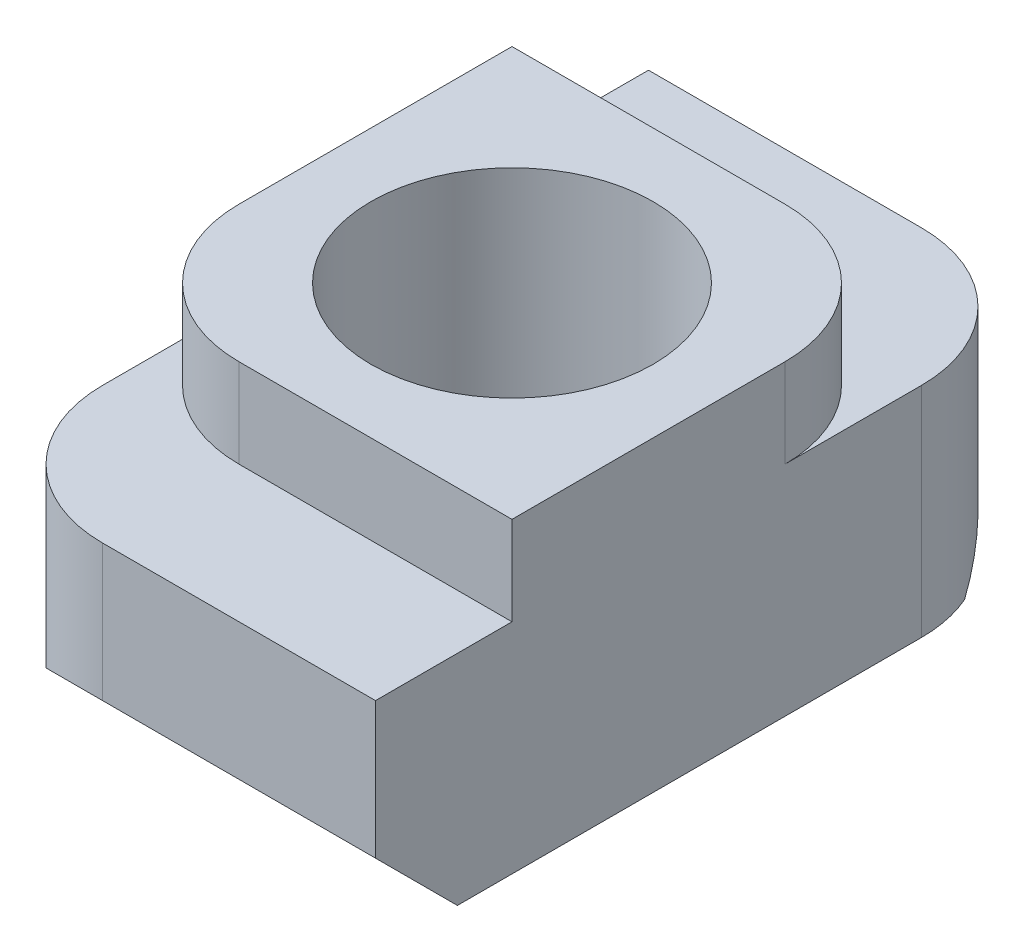
ISO-10303-21;
HEADER;
FILE_DESCRIPTION(('STEP AP214'),'2;1');
FILE_NAME('part.step','',(''),(''),'','','');
FILE_SCHEMA(('AUTOMOTIVE_DESIGN { 1 0 10303 214 1 1 1 1 }'));
ENDSEC;
DATA;
#1=APPLICATION_CONTEXT('core data for automotive mechanical design processes');
#2=APPLICATION_PROTOCOL_DEFINITION('international standard','automotive_design',2000,#1);
#3=PRODUCT_CONTEXT('',#1,'mechanical');
#4=PRODUCT('Part','Part','',(#3));
#5=PRODUCT_RELATED_PRODUCT_CATEGORY('part','',(#4));
#6=PRODUCT_DEFINITION_FORMATION('','',#4);
#7=PRODUCT_DEFINITION_CONTEXT('part definition',#1,'design');
#8=PRODUCT_DEFINITION('design','',#6,#7);
#9=PRODUCT_DEFINITION_SHAPE('','',#8);
#10=(LENGTH_UNIT() NAMED_UNIT(*) SI_UNIT(.MILLI.,.METRE.));
#11=(NAMED_UNIT(*) PLANE_ANGLE_UNIT() SI_UNIT($,.RADIAN.));
#12=(NAMED_UNIT(*) SI_UNIT($,.STERADIAN.) SOLID_ANGLE_UNIT());
#13=UNCERTAINTY_MEASURE_WITH_UNIT(LENGTH_MEASURE(1.E-05),#10,'distance_accuracy_value','');
#14=(GEOMETRIC_REPRESENTATION_CONTEXT(3) GLOBAL_UNCERTAINTY_ASSIGNED_CONTEXT((#13)) GLOBAL_UNIT_ASSIGNED_CONTEXT((#10,
#11,#12)) REPRESENTATION_CONTEXT('',''));
#15=CARTESIAN_POINT('',(0.,0.,0.));
#16=DIRECTION('',(0.,0.,1.));
#17=DIRECTION('',(1.,0.,0.));
#18=AXIS2_PLACEMENT_3D('',#15,#16,#17);
#19=CARTESIAN_POINT('',(3.,-1.3,3.));
#20=DIRECTION('',(0.,0.,-1.));
#21=DIRECTION('',(-1.,0.,0.));
#22=AXIS2_PLACEMENT_3D('',#19,#20,#21);
#23=PLANE('',#22);
#24=DIRECTION('',(-1.,0.,0.));
#25=VECTOR('',#24,1.);
#26=CARTESIAN_POINT('',(3.,0.,3.));
#27=LINE('',#26,#25);
#28=CARTESIAN_POINT('',(3.,0.,3.));
#29=VERTEX_POINT('',#28);
#30=CARTESIAN_POINT('',(-1.,0.,3.));
#31=VERTEX_POINT('',#30);
#32=EDGE_CURVE('E225',#29,#31,#27,.T.);
#33=ORIENTED_EDGE('',*,*,#32,.T.);
#34=DIRECTION('',(0.,-1.,0.));
#35=VECTOR('',#34,1.);
#36=CARTESIAN_POINT('',(-1.,-1.3,3.));
#37=LINE('',#36,#35);
#38=CARTESIAN_POINT('',(-1.,-1.3,3.));
#39=VERTEX_POINT('',#38);
#40=EDGE_CURVE('E163',#31,#39,#37,.T.);
#41=ORIENTED_EDGE('',*,*,#40,.T.);
#42=DIRECTION('',(-1.,0.,0.));
#43=VECTOR('',#42,1.);
#44=CARTESIAN_POINT('',(3.,-1.3,3.));
#45=LINE('',#44,#43);
#46=CARTESIAN_POINT('',(3.,-1.3,3.));
#47=VERTEX_POINT('',#46);
#48=EDGE_CURVE('E142',#47,#39,#45,.T.);
#49=ORIENTED_EDGE('',*,*,#48,.F.);
#50=DIRECTION('',(0.,-1.,0.));
#51=VECTOR('',#50,1.);
#52=CARTESIAN_POINT('',(3.,-1.3,3.));
#53=LINE('',#52,#51);
#54=EDGE_CURVE('E148',#29,#47,#53,.T.);
#55=ORIENTED_EDGE('',*,*,#54,.F.);
#56=EDGE_LOOP('',(#33,#41,#49,#55));
#57=FACE_BOUND('',#56,.T.);
#58=ADVANCED_FACE('F38',(#57),#23,.F.);
#59=CARTESIAN_POINT('',(3.,-1.3,5.));
#60=DIRECTION('',(0.,-1.,0.));
#61=DIRECTION('',(0.,0.,-1.));
#62=AXIS2_PLACEMENT_3D('',#59,#60,#61);
#63=PLANE('',#62);
#64=ORIENTED_EDGE('',*,*,#48,.T.);
#65=CARTESIAN_POINT('',(-1.,-1.3,1.));
#66=DIRECTION('',(0.,-1.,0.));
#67=DIRECTION('',(0.,0.,-1.));
#68=AXIS2_PLACEMENT_3D('',#65,#66,#67);
#69=CIRCLE('',#68,2.);
#70=CARTESIAN_POINT('',(-3.,-1.3,1.));
#71=VERTEX_POINT('',#70);
#72=EDGE_CURVE('E11',#39,#71,#69,.T.);
#73=ORIENTED_EDGE('',*,*,#72,.T.);
#74=DIRECTION('',(0.,0.,1.));
#75=VECTOR('',#74,1.);
#76=CARTESIAN_POINT('',(-3.,-1.3,5.));
#77=LINE('',#76,#75);
#78=CARTESIAN_POINT('',(-3.,-1.3,3.));
#79=VERTEX_POINT('',#78);
#80=EDGE_CURVE('E52',#79,#71,#77,.F.);
#81=ORIENTED_EDGE('',*,*,#80,.F.);
#82=CARTESIAN_POINT('',(-1.,-1.3,3.));
#83=DIRECTION('',(0.,-1.,0.));
#84=DIRECTION('',(0.,0.,-1.));
#85=AXIS2_PLACEMENT_3D('',#82,#83,#84);
#86=CIRCLE('',#85,2.);
#87=CARTESIAN_POINT('',(-1.,-1.3,5.));
#88=VERTEX_POINT('',#87);
#89=EDGE_CURVE('E202',#79,#88,#86,.F.);
#90=ORIENTED_EDGE('',*,*,#89,.T.);
#91=DIRECTION('',(-1.,0.,0.));
#92=VECTOR('',#91,1.);
#93=CARTESIAN_POINT('',(3.,-1.3,5.));
#94=LINE('',#93,#92);
#95=CARTESIAN_POINT('',(3.,-1.3,5.));
#96=VERTEX_POINT('',#95);
#97=EDGE_CURVE('E144',#96,#88,#94,.T.);
#98=ORIENTED_EDGE('',*,*,#97,.F.);
#99=DIRECTION('',(0.,0.,1.));
#100=VECTOR('',#99,1.);
#101=CARTESIAN_POINT('',(3.,-1.3,5.));
#102=LINE('',#101,#100);
#103=EDGE_CURVE('E138',#47,#96,#102,.T.);
#104=ORIENTED_EDGE('',*,*,#103,.F.);
#105=EDGE_LOOP('',(#64,#73,#81,#90,#98,#104));
#106=FACE_BOUND('',#105,.T.);
#107=ADVANCED_FACE('F140',(#106),#63,.F.);
#108=CARTESIAN_POINT('',(3.,-3.3,5.));
#109=DIRECTION('',(0.,0.,-1.));
#110=DIRECTION('',(-1.,0.,0.));
#111=AXIS2_PLACEMENT_3D('',#108,#109,#110);
#112=PLANE('',#111);
#113=ORIENTED_EDGE('',*,*,#97,.T.);
#114=DIRECTION('',(0.,-1.,0.));
#115=VECTOR('',#114,1.);
#116=CARTESIAN_POINT('',(-1.,-3.3,5.));
#117=LINE('',#116,#115);
#118=CARTESIAN_POINT('',(-1.,-3.3,5.));
#119=VERTEX_POINT('',#118);
#120=EDGE_CURVE('E197',#88,#119,#117,.T.);
#121=ORIENTED_EDGE('',*,*,#120,.T.);
#122=DIRECTION('',(-1.,0.,0.));
#123=VECTOR('',#122,1.);
#124=CARTESIAN_POINT('',(3.,-3.3,5.));
#125=LINE('',#124,#123);
#126=CARTESIAN_POINT('',(3.,-3.3,5.));
#127=VERTEX_POINT('',#126);
#128=EDGE_CURVE('E169',#127,#119,#125,.T.);
#129=ORIENTED_EDGE('',*,*,#128,.F.);
#130=DIRECTION('',(0.,-1.,0.));
#131=VECTOR('',#130,1.);
#132=CARTESIAN_POINT('',(3.,-3.3,5.));
#133=LINE('',#132,#131);
#134=EDGE_CURVE('E147',#96,#127,#133,.T.);
#135=ORIENTED_EDGE('',*,*,#134,.F.);
#136=EDGE_LOOP('',(#113,#121,#129,#135));
#137=FACE_BOUND('',#136,.T.);
#138=ADVANCED_FACE('F247',(#137),#112,.F.);
#139=CARTESIAN_POINT('',(3.,-4.5,3.8));
#140=DIRECTION('',(0.,0.707106781186546,-0.707106781186548));
#141=DIRECTION('',(0.,0.707106781186549,0.707106781186547));
#142=AXIS2_PLACEMENT_3D('',#139,#140,#141);
#143=PLANE('',#142);
#144=ORIENTED_EDGE('',*,*,#128,.T.);
#145=CARTESIAN_POINT('',(-1.,-5.30000000000001,3.));
#146=DIRECTION('',(0.,0.707106781186546,-0.707106781186548));
#147=DIRECTION('',(0.,0.707106781186549,0.707106781186547));
#148=AXIS2_PLACEMENT_3D('',#145,#146,#147);
#149=ELLIPSE('',#148,2.82842712474619,2.);
#150=CARTESIAN_POINT('',(-2.83303027798233,-4.5,3.8));
#151=VERTEX_POINT('',#150);
#152=EDGE_CURVE('E200',#119,#151,#149,.F.);
#153=ORIENTED_EDGE('',*,*,#152,.T.);
#154=DIRECTION('',(-1.,0.,0.));
#155=VECTOR('',#154,1.);
#156=CARTESIAN_POINT('',(3.,-4.5,3.8));
#157=LINE('',#156,#155);
#158=CARTESIAN_POINT('',(3.,-4.5,3.8));
#159=VERTEX_POINT('',#158);
#160=EDGE_CURVE('E237',#159,#151,#157,.T.);
#161=ORIENTED_EDGE('',*,*,#160,.F.);
#162=DIRECTION('',(0.,-0.707106781186549,-0.707106781186547));
#163=VECTOR('',#162,1.);
#164=CARTESIAN_POINT('',(3.,-4.5,3.8));
#165=LINE('',#164,#163);
#166=EDGE_CURVE('E245',#127,#159,#165,.T.);
#167=ORIENTED_EDGE('',*,*,#166,.F.);
#168=EDGE_LOOP('',(#144,#153,#161,#167));
#169=FACE_BOUND('',#168,.T.);
#170=ADVANCED_FACE('F243',(#169),#143,.F.);
#171=CARTESIAN_POINT('',(3.,-4.5,-3.8));
#172=DIRECTION('',(0.,1.,0.));
#173=DIRECTION('',(0.,0.,1.));
#174=AXIS2_PLACEMENT_3D('',#171,#172,#173);
#175=PLANE('',#174);
#176=CARTESIAN_POINT('',(0.,-4.5,0.));
#177=DIRECTION('',(0.,1.,0.));
#178=DIRECTION('',(0.,0.,1.));
#179=AXIS2_PLACEMENT_3D('',#176,#177,#178);
#180=CIRCLE('',#179,2.067);
#181=CARTESIAN_POINT('',(0.,-4.5,2.067));
#182=VERTEX_POINT('',#181);
#183=EDGE_CURVE('E266',#182,#182,#180,.T.);
#184=ORIENTED_EDGE('',*,*,#183,.T.);
#185=EDGE_LOOP('',(#184));
#186=FACE_BOUND('',#185,.T.);
#187=DIRECTION('',(-1.,0.,0.));
#188=VECTOR('',#187,1.);
#189=CARTESIAN_POINT('',(3.,-4.5,-3.8));
#190=LINE('',#189,#188);
#191=CARTESIAN_POINT('',(2.83303027798234,-4.5,-3.8));
#192=VERTEX_POINT('',#191);
#193=CARTESIAN_POINT('',(-3.,-4.5,-3.8));
#194=VERTEX_POINT('',#193);
#195=EDGE_CURVE('E235',#192,#194,#190,.T.);
#196=ORIENTED_EDGE('',*,*,#195,.F.);
#197=CARTESIAN_POINT('',(1.,-4.5,-3.));
#198=DIRECTION('',(0.,1.,0.));
#199=DIRECTION('',(0.,0.,1.));
#200=AXIS2_PLACEMENT_3D('',#197,#198,#199);
#201=CIRCLE('',#200,2.);
#202=CARTESIAN_POINT('',(3.,-4.5,-3.));
#203=VERTEX_POINT('',#202);
#204=EDGE_CURVE('E195',#192,#203,#201,.F.);
#205=ORIENTED_EDGE('',*,*,#204,.T.);
#206=DIRECTION('',(0.,0.,-1.));
#207=VECTOR('',#206,1.);
#208=CARTESIAN_POINT('',(3.,-4.5,-3.8));
#209=LINE('',#208,#207);
#210=EDGE_CURVE('E338',#159,#203,#209,.T.);
#211=ORIENTED_EDGE('',*,*,#210,.F.);
#212=ORIENTED_EDGE('',*,*,#160,.T.);
#213=CARTESIAN_POINT('',(-1.,-4.5,3.));
#214=DIRECTION('',(0.,1.,0.));
#215=DIRECTION('',(0.,0.,1.));
#216=AXIS2_PLACEMENT_3D('',#213,#214,#215);
#217=CIRCLE('',#216,2.);
#218=CARTESIAN_POINT('',(-3.,-4.5,3.));
#219=VERTEX_POINT('',#218);
#220=EDGE_CURVE('E193',#151,#219,#217,.F.);
#221=ORIENTED_EDGE('',*,*,#220,.T.);
#222=DIRECTION('',(0.,0.,-1.));
#223=VECTOR('',#222,1.);
#224=CARTESIAN_POINT('',(-3.,-4.5,-3.8));
#225=LINE('',#224,#223);
#226=EDGE_CURVE('E258',#219,#194,#225,.T.);
#227=ORIENTED_EDGE('',*,*,#226,.T.);
#228=EDGE_LOOP('',(#196,#205,#211,#212,#221,#227));
#229=FACE_BOUND('',#228,.T.);
#230=ADVANCED_FACE('F257',(#186,#229),#175,.F.);
#231=CARTESIAN_POINT('',(3.,-3.3,-5.));
#232=DIRECTION('',(0.,0.707106781186549,0.707106781186547));
#233=DIRECTION('',(0.,-0.707106781186547,0.707106781186549));
#234=AXIS2_PLACEMENT_3D('',#231,#232,#233);
#235=PLANE('',#234);
#236=DIRECTION('',(-1.,0.,0.));
#237=VECTOR('',#236,1.);
#238=CARTESIAN_POINT('',(3.,-3.3,-5.));
#239=LINE('',#238,#237);
#240=CARTESIAN_POINT('',(1.,-3.3,-5.));
#241=VERTEX_POINT('',#240);
#242=CARTESIAN_POINT('',(-3.,-3.3,-5.));
#243=VERTEX_POINT('',#242);
#244=EDGE_CURVE('E233',#241,#243,#239,.T.);
#245=ORIENTED_EDGE('',*,*,#244,.F.);
#246=CARTESIAN_POINT('',(1.,-5.29999999999999,-3.));
#247=DIRECTION('',(0.,0.707106781186549,0.707106781186547));
#248=DIRECTION('',(0.,0.707106781186547,-0.707106781186549));
#249=AXIS2_PLACEMENT_3D('',#246,#247,#248);
#250=ELLIPSE('',#249,2.82842712474619,2.);
#251=EDGE_CURVE('E191',#241,#192,#250,.F.);
#252=ORIENTED_EDGE('',*,*,#251,.T.);
#253=ORIENTED_EDGE('',*,*,#195,.T.);
#254=DIRECTION('',(0.,0.707106781186546,-0.707106781186548));
#255=VECTOR('',#254,1.);
#256=CARTESIAN_POINT('',(-3.,-3.3,-5.));
#257=LINE('',#256,#255);
#258=EDGE_CURVE('E265',#194,#243,#257,.T.);
#259=ORIENTED_EDGE('',*,*,#258,.T.);
#260=EDGE_LOOP('',(#245,#252,#253,#259));
#261=FACE_BOUND('',#260,.T.);
#262=ADVANCED_FACE('F305',(#261),#235,.F.);
#263=CARTESIAN_POINT('',(3.,-1.3,-5.));
#264=DIRECTION('',(0.,0.,1.));
#265=DIRECTION('',(1.,0.,0.));
#266=AXIS2_PLACEMENT_3D('',#263,#264,#265);
#267=PLANE('',#266);
#268=DIRECTION('',(-1.,0.,0.));
#269=VECTOR('',#268,1.);
#270=CARTESIAN_POINT('',(3.,-1.3,-5.));
#271=LINE('',#270,#269);
#272=CARTESIAN_POINT('',(1.,-1.3,-5.));
#273=VERTEX_POINT('',#272);
#274=CARTESIAN_POINT('',(-3.,-1.3,-5.));
#275=VERTEX_POINT('',#274);
#276=EDGE_CURVE('E227',#273,#275,#271,.T.);
#277=ORIENTED_EDGE('',*,*,#276,.F.);
#278=DIRECTION('',(0.,1.,0.));
#279=VECTOR('',#278,1.);
#280=CARTESIAN_POINT('',(1.,-1.3,-5.));
#281=LINE('',#280,#279);
#282=EDGE_CURVE('E189',#273,#241,#281,.F.);
#283=ORIENTED_EDGE('',*,*,#282,.T.);
#284=ORIENTED_EDGE('',*,*,#244,.T.);
#285=DIRECTION('',(0.,1.,0.));
#286=VECTOR('',#285,1.);
#287=CARTESIAN_POINT('',(-3.,-1.3,-5.));
#288=LINE('',#287,#286);
#289=EDGE_CURVE('E268',#243,#275,#288,.T.);
#290=ORIENTED_EDGE('',*,*,#289,.T.);
#291=EDGE_LOOP('',(#277,#283,#284,#290));
#292=FACE_BOUND('',#291,.T.);
#293=ADVANCED_FACE('F309',(#292),#267,.F.);
#294=CARTESIAN_POINT('',(3.,-1.3,-3.));
#295=DIRECTION('',(0.,-1.,0.));
#296=DIRECTION('',(0.,0.,-1.));
#297=AXIS2_PLACEMENT_3D('',#294,#295,#296);
#298=PLANE('',#297);
#299=DIRECTION('',(-1.,0.,0.));
#300=VECTOR('',#299,1.);
#301=CARTESIAN_POINT('',(3.,-1.3,-3.));
#302=LINE('',#301,#300);
#303=CARTESIAN_POINT('',(1.,-1.3,-3.));
#304=VERTEX_POINT('',#303);
#305=CARTESIAN_POINT('',(-3.,-1.3,-3.));
#306=VERTEX_POINT('',#305);
#307=EDGE_CURVE('E208',#304,#306,#302,.T.);
#308=ORIENTED_EDGE('',*,*,#307,.F.);
#309=CARTESIAN_POINT('',(1.,-1.3,-1.));
#310=DIRECTION('',(0.,-1.,0.));
#311=DIRECTION('',(0.,0.,-1.));
#312=AXIS2_PLACEMENT_3D('',#309,#310,#311);
#313=CIRCLE('',#312,2.);
#314=CARTESIAN_POINT('',(3.,-1.3,-1.));
#315=VERTEX_POINT('',#314);
#316=EDGE_CURVE('E46',#304,#315,#313,.T.);
#317=ORIENTED_EDGE('',*,*,#316,.T.);
#318=DIRECTION('',(0.,0.,1.));
#319=VECTOR('',#318,1.);
#320=CARTESIAN_POINT('',(3.,-1.3,-3.));
#321=LINE('',#320,#319);
#322=CARTESIAN_POINT('',(3.,-1.3,-3.));
#323=VERTEX_POINT('',#322);
#324=EDGE_CURVE('E167',#323,#315,#321,.T.);
#325=ORIENTED_EDGE('',*,*,#324,.F.);
#326=CARTESIAN_POINT('',(1.,-1.3,-3.));
#327=DIRECTION('',(0.,-1.,0.));
#328=DIRECTION('',(0.,0.,-1.));
#329=AXIS2_PLACEMENT_3D('',#326,#327,#328);
#330=CIRCLE('',#329,2.);
#331=EDGE_CURVE('E60',#323,#273,#330,.F.);
#332=ORIENTED_EDGE('',*,*,#331,.T.);
#333=ORIENTED_EDGE('',*,*,#276,.T.);
#334=DIRECTION('',(0.,0.,1.));
#335=VECTOR('',#334,1.);
#336=CARTESIAN_POINT('',(-3.,-1.3,-3.));
#337=LINE('',#336,#335);
#338=EDGE_CURVE('E278',#275,#306,#337,.T.);
#339=ORIENTED_EDGE('',*,*,#338,.T.);
#340=EDGE_LOOP('',(#308,#317,#325,#332,#333,#339));
#341=FACE_BOUND('',#340,.T.);
#342=ADVANCED_FACE('F206',(#341),#298,.F.);
#343=CARTESIAN_POINT('',(3.,0.,-3.));
#344=DIRECTION('',(0.,0.,1.));
#345=DIRECTION('',(1.,0.,0.));
#346=AXIS2_PLACEMENT_3D('',#343,#344,#345);
#347=PLANE('',#346);
#348=DIRECTION('',(-1.,0.,0.));
#349=VECTOR('',#348,1.);
#350=CARTESIAN_POINT('',(3.,0.,-3.));
#351=LINE('',#350,#349);
#352=CARTESIAN_POINT('',(1.,0.,-3.));
#353=VERTEX_POINT('',#352);
#354=CARTESIAN_POINT('',(-3.,0.,-3.));
#355=VERTEX_POINT('',#354);
#356=EDGE_CURVE('E218',#353,#355,#351,.T.);
#357=ORIENTED_EDGE('',*,*,#356,.F.);
#358=DIRECTION('',(0.,1.,0.));
#359=VECTOR('',#358,1.);
#360=CARTESIAN_POINT('',(1.,0.,-3.));
#361=LINE('',#360,#359);
#362=EDGE_CURVE('E180',#353,#304,#361,.F.);
#363=ORIENTED_EDGE('',*,*,#362,.T.);
#364=ORIENTED_EDGE('',*,*,#307,.T.);
#365=DIRECTION('',(0.,1.,0.));
#366=VECTOR('',#365,1.);
#367=CARTESIAN_POINT('',(-3.,0.,-3.));
#368=LINE('',#367,#366);
#369=EDGE_CURVE('E223',#306,#355,#368,.T.);
#370=ORIENTED_EDGE('',*,*,#369,.T.);
#371=EDGE_LOOP('',(#357,#363,#364,#370));
#372=FACE_BOUND('',#371,.T.);
#373=ADVANCED_FACE('F221',(#372),#347,.F.);
#374=CARTESIAN_POINT('',(3.,0.,3.));
#375=DIRECTION('',(0.,-1.,0.));
#376=DIRECTION('',(0.,0.,-1.));
#377=AXIS2_PLACEMENT_3D('',#374,#375,#376);
#378=PLANE('',#377);
#379=CARTESIAN_POINT('',(0.,0.,0.));
#380=DIRECTION('',(0.,1.,0.));
#381=DIRECTION('',(0.,0.,1.));
#382=AXIS2_PLACEMENT_3D('',#379,#380,#381);
#383=CIRCLE('',#382,2.067);
#384=CARTESIAN_POINT('',(0.,0.,2.067));
#385=VERTEX_POINT('',#384);
#386=EDGE_CURVE('E271',#385,#385,#383,.T.);
#387=ORIENTED_EDGE('',*,*,#386,.F.);
#388=EDGE_LOOP('',(#387));
#389=FACE_BOUND('',#388,.T.);
#390=DIRECTION('',(0.,0.,1.));
#391=VECTOR('',#390,1.);
#392=CARTESIAN_POINT('',(3.,0.,3.));
#393=LINE('',#392,#391);
#394=CARTESIAN_POINT('',(3.,0.,-1.));
#395=VERTEX_POINT('',#394);
#396=EDGE_CURVE('E155',#395,#29,#393,.T.);
#397=ORIENTED_EDGE('',*,*,#396,.F.);
#398=CARTESIAN_POINT('',(1.,0.,-1.));
#399=DIRECTION('',(0.,-1.,0.));
#400=DIRECTION('',(0.,0.,-1.));
#401=AXIS2_PLACEMENT_3D('',#398,#399,#400);
#402=CIRCLE('',#401,2.);
#403=EDGE_CURVE('E178',#395,#353,#402,.F.);
#404=ORIENTED_EDGE('',*,*,#403,.T.);
#405=ORIENTED_EDGE('',*,*,#356,.T.);
#406=DIRECTION('',(0.,0.,1.));
#407=VECTOR('',#406,1.);
#408=CARTESIAN_POINT('',(-3.,0.,3.));
#409=LINE('',#408,#407);
#410=CARTESIAN_POINT('',(-3.,0.,1.));
#411=VERTEX_POINT('',#410);
#412=EDGE_CURVE('E159',#355,#411,#409,.T.);
#413=ORIENTED_EDGE('',*,*,#412,.T.);
#414=CARTESIAN_POINT('',(-1.,0.,1.));
#415=DIRECTION('',(0.,-1.,0.));
#416=DIRECTION('',(0.,0.,-1.));
#417=AXIS2_PLACEMENT_3D('',#414,#415,#416);
#418=CIRCLE('',#417,2.);
#419=EDGE_CURVE('E176',#411,#31,#418,.F.);
#420=ORIENTED_EDGE('',*,*,#419,.T.);
#421=ORIENTED_EDGE('',*,*,#32,.F.);
#422=EDGE_LOOP('',(#397,#404,#405,#413,#420,#421));
#423=FACE_BOUND('',#422,.T.);
#424=ADVANCED_FACE('F216',(#389,#423),#378,.F.);
#425=CARTESIAN_POINT('',(3.,0.,0.));
#426=DIRECTION('',(-1.,0.,0.));
#427=DIRECTION('',(0.,0.,1.));
#428=AXIS2_PLACEMENT_3D('',#425,#426,#427);
#429=PLANE('',#428);
#430=ORIENTED_EDGE('',*,*,#324,.T.);
#431=DIRECTION('',(0.,1.,0.));
#432=VECTOR('',#431,1.);
#433=CARTESIAN_POINT('',(3.,0.,-1.));
#434=LINE('',#433,#432);
#435=EDGE_CURVE('E174',#315,#395,#434,.T.);
#436=ORIENTED_EDGE('',*,*,#435,.T.);
#437=ORIENTED_EDGE('',*,*,#396,.T.);
#438=ORIENTED_EDGE('',*,*,#54,.T.);
#439=ORIENTED_EDGE('',*,*,#103,.T.);
#440=ORIENTED_EDGE('',*,*,#134,.T.);
#441=ORIENTED_EDGE('',*,*,#166,.T.);
#442=ORIENTED_EDGE('',*,*,#210,.T.);
#443=DIRECTION('',(0.,1.,0.));
#444=VECTOR('',#443,1.);
#445=CARTESIAN_POINT('',(3.,0.,-3.));
#446=LINE('',#445,#444);
#447=EDGE_CURVE('E164',#203,#323,#446,.T.);
#448=ORIENTED_EDGE('',*,*,#447,.T.);
#449=EDGE_LOOP('',(#430,#436,#437,#438,#439,#440,#441,#442,#448));
#450=FACE_BOUND('',#449,.T.);
#451=ADVANCED_FACE('F152',(#450),#429,.F.);
#452=CARTESIAN_POINT('',(-3.,0.,0.));
#453=DIRECTION('',(-1.,0.,0.));
#454=DIRECTION('',(0.,0.,1.));
#455=AXIS2_PLACEMENT_3D('',#452,#453,#454);
#456=PLANE('',#455);
#457=ORIENTED_EDGE('',*,*,#80,.T.);
#458=DIRECTION('',(0.,-1.,0.));
#459=VECTOR('',#458,1.);
#460=CARTESIAN_POINT('',(-3.,0.,1.));
#461=LINE('',#460,#459);
#462=EDGE_CURVE('E186',#71,#411,#461,.F.);
#463=ORIENTED_EDGE('',*,*,#462,.T.);
#464=ORIENTED_EDGE('',*,*,#412,.F.);
#465=ORIENTED_EDGE('',*,*,#369,.F.);
#466=ORIENTED_EDGE('',*,*,#338,.F.);
#467=ORIENTED_EDGE('',*,*,#289,.F.);
#468=ORIENTED_EDGE('',*,*,#258,.F.);
#469=ORIENTED_EDGE('',*,*,#226,.F.);
#470=DIRECTION('',(0.,-1.,0.));
#471=VECTOR('',#470,1.);
#472=CARTESIAN_POINT('',(-3.,-1.3,3.));
#473=LINE('',#472,#471);
#474=EDGE_CURVE('E183',#219,#79,#473,.F.);
#475=ORIENTED_EDGE('',*,*,#474,.T.);
#476=EDGE_LOOP('',(#457,#463,#464,#465,#466,#467,#468,#469,#475));
#477=FACE_BOUND('',#476,.T.);
#478=ADVANCED_FACE('F262',(#477),#456,.T.);
#479=CARTESIAN_POINT('',(1.,0.,-1.));
#480=DIRECTION('',(0.,1.,0.));
#481=DIRECTION('',(0.,0.,1.));
#482=AXIS2_PLACEMENT_3D('',#479,#480,#481);
#483=CYLINDRICAL_SURFACE('',#482,2.);
#484=ORIENTED_EDGE('',*,*,#316,.F.);
#485=ORIENTED_EDGE('',*,*,#362,.F.);
#486=ORIENTED_EDGE('',*,*,#403,.F.);
#487=ORIENTED_EDGE('',*,*,#435,.F.);
#488=EDGE_LOOP('',(#484,#485,#486,#487));
#489=FACE_BOUND('',#488,.T.);
#490=ADVANCED_FACE('F213',(#489),#483,.T.);
#491=CARTESIAN_POINT('',(-1.,-1.3,1.));
#492=DIRECTION('',(0.,1.,0.));
#493=DIRECTION('',(0.,0.,1.));
#494=AXIS2_PLACEMENT_3D('',#491,#492,#493);
#495=CYLINDRICAL_SURFACE('',#494,2.);
#496=ORIENTED_EDGE('',*,*,#419,.F.);
#497=ORIENTED_EDGE('',*,*,#462,.F.);
#498=ORIENTED_EDGE('',*,*,#72,.F.);
#499=ORIENTED_EDGE('',*,*,#40,.F.);
#500=EDGE_LOOP('',(#496,#497,#498,#499));
#501=FACE_BOUND('',#500,.T.);
#502=ADVANCED_FACE('F283',(#501),#495,.T.);
#503=CARTESIAN_POINT('',(1.,0.,-3.));
#504=DIRECTION('',(0.,1.,0.));
#505=DIRECTION('',(0.,0.,1.));
#506=AXIS2_PLACEMENT_3D('',#503,#504,#505);
#507=CYLINDRICAL_SURFACE('',#506,2.);
#508=ORIENTED_EDGE('',*,*,#251,.F.);
#509=ORIENTED_EDGE('',*,*,#282,.F.);
#510=ORIENTED_EDGE('',*,*,#331,.F.);
#511=ORIENTED_EDGE('',*,*,#447,.F.);
#512=ORIENTED_EDGE('',*,*,#204,.F.);
#513=EDGE_LOOP('',(#508,#509,#510,#511,#512));
#514=FACE_BOUND('',#513,.T.);
#515=ADVANCED_FACE('F285',(#514),#507,.T.);
#516=CARTESIAN_POINT('',(-1.,-3.3,3.));
#517=DIRECTION('',(0.,1.,0.));
#518=DIRECTION('',(0.,0.,1.));
#519=AXIS2_PLACEMENT_3D('',#516,#517,#518);
#520=CYLINDRICAL_SURFACE('',#519,2.);
#521=ORIENTED_EDGE('',*,*,#89,.F.);
#522=ORIENTED_EDGE('',*,*,#474,.F.);
#523=ORIENTED_EDGE('',*,*,#220,.F.);
#524=ORIENTED_EDGE('',*,*,#152,.F.);
#525=ORIENTED_EDGE('',*,*,#120,.F.);
#526=EDGE_LOOP('',(#521,#522,#523,#524,#525));
#527=FACE_BOUND('',#526,.T.);
#528=ADVANCED_FACE('F40',(#527),#520,.T.);
#529=CARTESIAN_POINT('',(0.,0.,0.));
#530=DIRECTION('',(0.,1.,0.));
#531=DIRECTION('',(0.,0.,1.));
#532=AXIS2_PLACEMENT_3D('',#529,#530,#531);
#533=CYLINDRICAL_SURFACE('',#532,2.067);
#534=ORIENTED_EDGE('',*,*,#183,.F.);
#535=EDGE_LOOP('',(#534));
#536=FACE_BOUND('',#535,.T.);
#537=ORIENTED_EDGE('',*,*,#386,.T.);
#538=EDGE_LOOP('',(#537));
#539=FACE_BOUND('',#538,.T.);
#540=ADVANCED_FACE('F325',(#536,#539),#533,.F.);
#541=CLOSED_SHELL('',(#58,#107,#138,#170,#230,#262,#293,#342,#373,#424,#451,#478,#490,#502,#515,
#528,#540));
#542=MANIFOLD_SOLID_BREP('B2',#541);
#543=ADVANCED_BREP_SHAPE_REPRESENTATION('',(#18,#542),#14);
#544=SHAPE_DEFINITION_REPRESENTATION(#9,#543);
ENDSEC;
END-ISO-10303-21;
